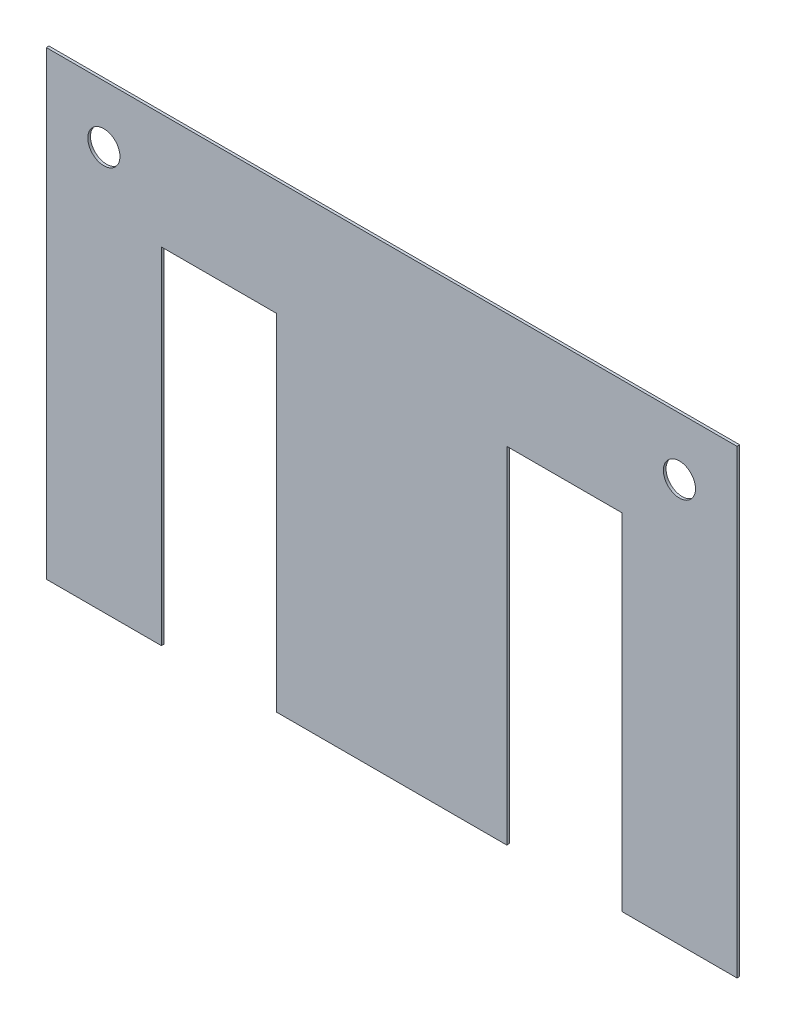
ISO-10303-21;
HEADER;
FILE_DESCRIPTION(('STEP AP214'),'2;1');
FILE_NAME('part.step','',(''),(''),'','','');
FILE_SCHEMA(('AUTOMOTIVE_DESIGN { 1 0 10303 214 1 1 1 1 }'));
ENDSEC;
DATA;
#1=APPLICATION_CONTEXT('core data for automotive mechanical design processes');
#2=APPLICATION_PROTOCOL_DEFINITION('international standard','automotive_design',2000,#1);
#3=PRODUCT_CONTEXT('',#1,'mechanical');
#4=PRODUCT('Part','Part','',(#3));
#5=PRODUCT_RELATED_PRODUCT_CATEGORY('part','',(#4));
#6=PRODUCT_DEFINITION_FORMATION('','',#4);
#7=PRODUCT_DEFINITION_CONTEXT('part definition',#1,'design');
#8=PRODUCT_DEFINITION('design','',#6,#7);
#9=PRODUCT_DEFINITION_SHAPE('','',#8);
#10=(LENGTH_UNIT() NAMED_UNIT(*) SI_UNIT(.MILLI.,.METRE.));
#11=(NAMED_UNIT(*) PLANE_ANGLE_UNIT() SI_UNIT($,.RADIAN.));
#12=(NAMED_UNIT(*) SI_UNIT($,.STERADIAN.) SOLID_ANGLE_UNIT());
#13=UNCERTAINTY_MEASURE_WITH_UNIT(LENGTH_MEASURE(1.E-05),#10,'distance_accuracy_value','');
#14=(GEOMETRIC_REPRESENTATION_CONTEXT(3) GLOBAL_UNCERTAINTY_ASSIGNED_CONTEXT((#13)) GLOBAL_UNIT_ASSIGNED_CONTEXT((#10,
#11,#12)) REPRESENTATION_CONTEXT('',''));
#15=CARTESIAN_POINT('',(0.,0.,0.));
#16=DIRECTION('',(0.,0.,1.));
#17=DIRECTION('',(1.,0.,0.));
#18=AXIS2_PLACEMENT_3D('',#15,#16,#17);
#19=CARTESIAN_POINT('',(0.,0.,0.5));
#20=DIRECTION('',(0.,0.,-1.));
#21=DIRECTION('',(-1.,0.,0.));
#22=AXIS2_PLACEMENT_3D('',#19,#20,#21);
#23=PLANE('',#22);
#24=CARTESIAN_POINT('',(10.75,75.25,0.5));
#25=DIRECTION('',(0.,0.,1.));
#26=DIRECTION('',(1.,0.,0.));
#27=AXIS2_PLACEMENT_3D('',#24,#25,#26);
#28=CIRCLE('',#27,3.);
#29=CARTESIAN_POINT('',(13.75,75.25,0.5));
#30=VERTEX_POINT('',#29);
#31=EDGE_CURVE('E159',#30,#30,#28,.T.);
#32=ORIENTED_EDGE('',*,*,#31,.F.);
#33=EDGE_LOOP('',(#32));
#34=FACE_BOUND('',#33,.T.);
#35=DIRECTION('',(1.,0.,0.));
#36=VECTOR('',#35,1.);
#37=CARTESIAN_POINT('',(21.5000000000001,0.,0.5));
#38=LINE('',#37,#36);
#39=CARTESIAN_POINT('',(0.,0.,0.5));
#40=VERTEX_POINT('',#39);
#41=CARTESIAN_POINT('',(21.5000000000001,0.,0.5));
#42=VERTEX_POINT('',#41);
#43=EDGE_CURVE('E178',#40,#42,#38,.T.);
#44=ORIENTED_EDGE('',*,*,#43,.T.);
#45=DIRECTION('',(0.,1.,0.));
#46=VECTOR('',#45,1.);
#47=CARTESIAN_POINT('',(21.5000000000001,64.5,0.5));
#48=LINE('',#47,#46);
#49=CARTESIAN_POINT('',(21.5000000000001,64.5,0.5));
#50=VERTEX_POINT('',#49);
#51=EDGE_CURVE('E106',#42,#50,#48,.T.);
#52=ORIENTED_EDGE('',*,*,#51,.T.);
#53=DIRECTION('',(1.,0.,0.));
#54=VECTOR('',#53,1.);
#55=CARTESIAN_POINT('',(43.0000000000001,64.5,0.5));
#56=LINE('',#55,#54);
#57=CARTESIAN_POINT('',(43.0000000000001,64.5,0.5));
#58=VERTEX_POINT('',#57);
#59=EDGE_CURVE('E205',#50,#58,#56,.T.);
#60=ORIENTED_EDGE('',*,*,#59,.T.);
#61=DIRECTION('',(0.,-1.,0.));
#62=VECTOR('',#61,1.);
#63=CARTESIAN_POINT('',(43.,0.,0.5));
#64=LINE('',#63,#62);
#65=CARTESIAN_POINT('',(43.,0.,0.5));
#66=VERTEX_POINT('',#65);
#67=EDGE_CURVE('E224',#58,#66,#64,.T.);
#68=ORIENTED_EDGE('',*,*,#67,.T.);
#69=DIRECTION('',(1.,0.,0.));
#70=VECTOR('',#69,1.);
#71=CARTESIAN_POINT('',(86.,0.,0.5));
#72=LINE('',#71,#70);
#73=CARTESIAN_POINT('',(86.,0.,0.5));
#74=VERTEX_POINT('',#73);
#75=EDGE_CURVE('E221',#66,#74,#72,.T.);
#76=ORIENTED_EDGE('',*,*,#75,.T.);
#77=DIRECTION('',(0.,1.,0.));
#78=VECTOR('',#77,1.);
#79=CARTESIAN_POINT('',(86.,64.5,0.5));
#80=LINE('',#79,#78);
#81=CARTESIAN_POINT('',(86.,64.5,0.5));
#82=VERTEX_POINT('',#81);
#83=EDGE_CURVE('E223',#74,#82,#80,.T.);
#84=ORIENTED_EDGE('',*,*,#83,.T.);
#85=DIRECTION('',(1.,0.,0.));
#86=VECTOR('',#85,1.);
#87=CARTESIAN_POINT('',(107.5,64.5,0.5));
#88=LINE('',#87,#86);
#89=CARTESIAN_POINT('',(107.5,64.5,0.5));
#90=VERTEX_POINT('',#89);
#91=EDGE_CURVE('E226',#82,#90,#88,.T.);
#92=ORIENTED_EDGE('',*,*,#91,.T.);
#93=DIRECTION('',(0.,-1.,0.));
#94=VECTOR('',#93,1.);
#95=CARTESIAN_POINT('',(107.5,0.,0.5));
#96=LINE('',#95,#94);
#97=CARTESIAN_POINT('',(107.5,0.,0.5));
#98=VERTEX_POINT('',#97);
#99=EDGE_CURVE('E232',#90,#98,#96,.T.);
#100=ORIENTED_EDGE('',*,*,#99,.T.);
#101=DIRECTION('',(1.,0.,0.));
#102=VECTOR('',#101,1.);
#103=CARTESIAN_POINT('',(129.,0.,0.5));
#104=LINE('',#103,#102);
#105=CARTESIAN_POINT('',(129.,0.,0.5));
#106=VERTEX_POINT('',#105);
#107=EDGE_CURVE('E137',#98,#106,#104,.T.);
#108=ORIENTED_EDGE('',*,*,#107,.T.);
#109=DIRECTION('',(0.,1.,0.));
#110=VECTOR('',#109,1.);
#111=CARTESIAN_POINT('',(129.,86.,0.5));
#112=LINE('',#111,#110);
#113=CARTESIAN_POINT('',(129.,86.,0.5));
#114=VERTEX_POINT('',#113);
#115=EDGE_CURVE('E131',#106,#114,#112,.T.);
#116=ORIENTED_EDGE('',*,*,#115,.T.);
#117=DIRECTION('',(-1.,0.,0.));
#118=VECTOR('',#117,1.);
#119=CARTESIAN_POINT('',(0.,86.,0.5));
#120=LINE('',#119,#118);
#121=CARTESIAN_POINT('',(0.,86.,0.5));
#122=VERTEX_POINT('',#121);
#123=EDGE_CURVE('E135',#114,#122,#120,.T.);
#124=ORIENTED_EDGE('',*,*,#123,.T.);
#125=DIRECTION('',(0.,-1.,0.));
#126=VECTOR('',#125,1.);
#127=CARTESIAN_POINT('',(0.,0.,0.5));
#128=LINE('',#127,#126);
#129=EDGE_CURVE('E51',#122,#40,#128,.T.);
#130=ORIENTED_EDGE('',*,*,#129,.T.);
#131=EDGE_LOOP('',(#44,#52,#60,#68,#76,#84,#92,#100,#108,#116,#124,#130));
#132=FACE_BOUND('',#131,.T.);
#133=CARTESIAN_POINT('',(118.25,75.25,0.5));
#134=DIRECTION('',(0.,0.,1.));
#135=DIRECTION('',(1.,0.,0.));
#136=AXIS2_PLACEMENT_3D('',#133,#134,#135);
#137=CIRCLE('',#136,3.00000000000001);
#138=CARTESIAN_POINT('',(121.25,75.25,0.5));
#139=VERTEX_POINT('',#138);
#140=EDGE_CURVE('E275',#139,#139,#137,.T.);
#141=ORIENTED_EDGE('',*,*,#140,.F.);
#142=EDGE_LOOP('',(#141));
#143=FACE_BOUND('',#142,.T.);
#144=ADVANCED_FACE('F34',(#34,#132,#143),#23,.F.);
#145=CARTESIAN_POINT('',(0.,0.,0.));
#146=DIRECTION('',(0.,0.,-1.));
#147=DIRECTION('',(-1.,0.,0.));
#148=AXIS2_PLACEMENT_3D('',#145,#146,#147);
#149=PLANE('',#148);
#150=CARTESIAN_POINT('',(10.75,75.25,0.));
#151=DIRECTION('',(0.,0.,1.));
#152=DIRECTION('',(1.,0.,0.));
#153=AXIS2_PLACEMENT_3D('',#150,#151,#152);
#154=CIRCLE('',#153,3.);
#155=CARTESIAN_POINT('',(13.75,75.25,0.));
#156=VERTEX_POINT('',#155);
#157=EDGE_CURVE('E280',#156,#156,#154,.T.);
#158=ORIENTED_EDGE('',*,*,#157,.T.);
#159=EDGE_LOOP('',(#158));
#160=FACE_BOUND('',#159,.T.);
#161=DIRECTION('',(1.,0.,0.));
#162=VECTOR('',#161,1.);
#163=CARTESIAN_POINT('',(21.5000000000001,0.,0.));
#164=LINE('',#163,#162);
#165=CARTESIAN_POINT('',(0.,0.,0.));
#166=VERTEX_POINT('',#165);
#167=CARTESIAN_POINT('',(21.5000000000001,0.,0.));
#168=VERTEX_POINT('',#167);
#169=EDGE_CURVE('E155',#166,#168,#164,.T.);
#170=ORIENTED_EDGE('',*,*,#169,.F.);
#171=DIRECTION('',(0.,-1.,0.));
#172=VECTOR('',#171,1.);
#173=CARTESIAN_POINT('',(0.,0.,0.));
#174=LINE('',#173,#172);
#175=CARTESIAN_POINT('',(0.,86.,0.));
#176=VERTEX_POINT('',#175);
#177=EDGE_CURVE('E98',#176,#166,#174,.T.);
#178=ORIENTED_EDGE('',*,*,#177,.F.);
#179=DIRECTION('',(-1.,0.,0.));
#180=VECTOR('',#179,1.);
#181=CARTESIAN_POINT('',(0.,86.,0.));
#182=LINE('',#181,#180);
#183=CARTESIAN_POINT('',(129.,86.,0.));
#184=VERTEX_POINT('',#183);
#185=EDGE_CURVE('E92',#184,#176,#182,.T.);
#186=ORIENTED_EDGE('',*,*,#185,.F.);
#187=DIRECTION('',(0.,1.,0.));
#188=VECTOR('',#187,1.);
#189=CARTESIAN_POINT('',(129.,86.,0.));
#190=LINE('',#189,#188);
#191=CARTESIAN_POINT('',(129.,0.,0.));
#192=VERTEX_POINT('',#191);
#193=EDGE_CURVE('E145',#192,#184,#190,.T.);
#194=ORIENTED_EDGE('',*,*,#193,.F.);
#195=DIRECTION('',(1.,0.,0.));
#196=VECTOR('',#195,1.);
#197=CARTESIAN_POINT('',(129.,0.,0.));
#198=LINE('',#197,#196);
#199=CARTESIAN_POINT('',(107.5,0.,0.));
#200=VERTEX_POINT('',#199);
#201=EDGE_CURVE('E173',#200,#192,#198,.T.);
#202=ORIENTED_EDGE('',*,*,#201,.F.);
#203=DIRECTION('',(0.,-1.,0.));
#204=VECTOR('',#203,1.);
#205=CARTESIAN_POINT('',(107.5,0.,0.));
#206=LINE('',#205,#204);
#207=CARTESIAN_POINT('',(107.5,64.5,0.));
#208=VERTEX_POINT('',#207);
#209=EDGE_CURVE('E171',#208,#200,#206,.T.);
#210=ORIENTED_EDGE('',*,*,#209,.F.);
#211=DIRECTION('',(1.,0.,0.));
#212=VECTOR('',#211,1.);
#213=CARTESIAN_POINT('',(107.5,64.5,0.));
#214=LINE('',#213,#212);
#215=CARTESIAN_POINT('',(86.,64.5,0.));
#216=VERTEX_POINT('',#215);
#217=EDGE_CURVE('E169',#216,#208,#214,.T.);
#218=ORIENTED_EDGE('',*,*,#217,.F.);
#219=DIRECTION('',(0.,1.,0.));
#220=VECTOR('',#219,1.);
#221=CARTESIAN_POINT('',(86.,64.5,0.));
#222=LINE('',#221,#220);
#223=CARTESIAN_POINT('',(86.,0.,0.));
#224=VERTEX_POINT('',#223);
#225=EDGE_CURVE('E167',#224,#216,#222,.T.);
#226=ORIENTED_EDGE('',*,*,#225,.F.);
#227=DIRECTION('',(1.,0.,0.));
#228=VECTOR('',#227,1.);
#229=CARTESIAN_POINT('',(86.,0.,0.));
#230=LINE('',#229,#228);
#231=CARTESIAN_POINT('',(43.,0.,0.));
#232=VERTEX_POINT('',#231);
#233=EDGE_CURVE('E165',#232,#224,#230,.T.);
#234=ORIENTED_EDGE('',*,*,#233,.F.);
#235=DIRECTION('',(0.,-1.,0.));
#236=VECTOR('',#235,1.);
#237=CARTESIAN_POINT('',(43.,0.,0.));
#238=LINE('',#237,#236);
#239=CARTESIAN_POINT('',(43.0000000000001,64.5,0.));
#240=VERTEX_POINT('',#239);
#241=EDGE_CURVE('E163',#240,#232,#238,.T.);
#242=ORIENTED_EDGE('',*,*,#241,.F.);
#243=DIRECTION('',(1.,0.,0.));
#244=VECTOR('',#243,1.);
#245=CARTESIAN_POINT('',(43.0000000000001,64.5,0.));
#246=LINE('',#245,#244);
#247=CARTESIAN_POINT('',(21.5000000000001,64.5,0.));
#248=VERTEX_POINT('',#247);
#249=EDGE_CURVE('E161',#248,#240,#246,.T.);
#250=ORIENTED_EDGE('',*,*,#249,.F.);
#251=DIRECTION('',(0.,1.,0.));
#252=VECTOR('',#251,1.);
#253=CARTESIAN_POINT('',(21.5000000000001,64.5,0.));
#254=LINE('',#253,#252);
#255=EDGE_CURVE('E158',#168,#248,#254,.T.);
#256=ORIENTED_EDGE('',*,*,#255,.F.);
#257=EDGE_LOOP('',(#170,#178,#186,#194,#202,#210,#218,#226,#234,#242,#250,#256));
#258=FACE_BOUND('',#257,.T.);
#259=CARTESIAN_POINT('',(118.25,75.25,0.));
#260=DIRECTION('',(0.,0.,1.));
#261=DIRECTION('',(1.,0.,0.));
#262=AXIS2_PLACEMENT_3D('',#259,#260,#261);
#263=CIRCLE('',#262,3.00000000000001);
#264=CARTESIAN_POINT('',(121.25,75.25,0.));
#265=VERTEX_POINT('',#264);
#266=EDGE_CURVE('E278',#265,#265,#263,.T.);
#267=ORIENTED_EDGE('',*,*,#266,.T.);
#268=EDGE_LOOP('',(#267));
#269=FACE_BOUND('',#268,.T.);
#270=ADVANCED_FACE('F209',(#160,#258,#269),#149,.T.);
#271=CARTESIAN_POINT('',(21.5000000000001,0.,0.5));
#272=DIRECTION('',(0.,1.,0.));
#273=DIRECTION('',(-1.,0.,0.));
#274=AXIS2_PLACEMENT_3D('',#271,#272,#273);
#275=PLANE('',#274);
#276=ORIENTED_EDGE('',*,*,#169,.T.);
#277=DIRECTION('',(0.,0.,-1.));
#278=VECTOR('',#277,1.);
#279=CARTESIAN_POINT('',(21.5000000000001,0.,0.5));
#280=LINE('',#279,#278);
#281=EDGE_CURVE('E11',#42,#168,#280,.T.);
#282=ORIENTED_EDGE('',*,*,#281,.F.);
#283=ORIENTED_EDGE('',*,*,#43,.F.);
#284=DIRECTION('',(0.,0.,-1.));
#285=VECTOR('',#284,1.);
#286=CARTESIAN_POINT('',(0.,0.,0.5));
#287=LINE('',#286,#285);
#288=EDGE_CURVE('E151',#40,#166,#287,.T.);
#289=ORIENTED_EDGE('',*,*,#288,.T.);
#290=EDGE_LOOP('',(#276,#282,#283,#289));
#291=FACE_BOUND('',#290,.T.);
#292=ADVANCED_FACE('F36',(#291),#275,.F.);
#293=CARTESIAN_POINT('',(21.5000000000001,64.5,0.5));
#294=DIRECTION('',(-1.,0.,0.));
#295=DIRECTION('',(0.,-1.,0.));
#296=AXIS2_PLACEMENT_3D('',#293,#294,#295);
#297=PLANE('',#296);
#298=ORIENTED_EDGE('',*,*,#255,.T.);
#299=DIRECTION('',(0.,0.,-1.));
#300=VECTOR('',#299,1.);
#301=CARTESIAN_POINT('',(21.5000000000001,64.5,0.5));
#302=LINE('',#301,#300);
#303=EDGE_CURVE('E43',#50,#248,#302,.T.);
#304=ORIENTED_EDGE('',*,*,#303,.F.);
#305=ORIENTED_EDGE('',*,*,#51,.F.);
#306=ORIENTED_EDGE('',*,*,#281,.T.);
#307=EDGE_LOOP('',(#298,#304,#305,#306));
#308=FACE_BOUND('',#307,.T.);
#309=ADVANCED_FACE('F373',(#308),#297,.F.);
#310=CARTESIAN_POINT('',(43.0000000000001,64.5,0.5));
#311=DIRECTION('',(0.,1.,0.));
#312=DIRECTION('',(0.,0.,1.));
#313=AXIS2_PLACEMENT_3D('',#310,#311,#312);
#314=PLANE('',#313);
#315=ORIENTED_EDGE('',*,*,#249,.T.);
#316=DIRECTION('',(0.,0.,-1.));
#317=VECTOR('',#316,1.);
#318=CARTESIAN_POINT('',(43.0000000000001,64.5,0.5));
#319=LINE('',#318,#317);
#320=EDGE_CURVE('E197',#58,#240,#319,.T.);
#321=ORIENTED_EDGE('',*,*,#320,.F.);
#322=ORIENTED_EDGE('',*,*,#59,.F.);
#323=ORIENTED_EDGE('',*,*,#303,.T.);
#324=EDGE_LOOP('',(#315,#321,#322,#323));
#325=FACE_BOUND('',#324,.T.);
#326=ADVANCED_FACE('F203',(#325),#314,.F.);
#327=CARTESIAN_POINT('',(43.,0.,0.5));
#328=DIRECTION('',(1.,0.,0.));
#329=DIRECTION('',(0.,1.,0.));
#330=AXIS2_PLACEMENT_3D('',#327,#328,#329);
#331=PLANE('',#330);
#332=ORIENTED_EDGE('',*,*,#241,.T.);
#333=DIRECTION('',(0.,0.,-1.));
#334=VECTOR('',#333,1.);
#335=CARTESIAN_POINT('',(43.,0.,0.5));
#336=LINE('',#335,#334);
#337=EDGE_CURVE('E194',#66,#232,#336,.T.);
#338=ORIENTED_EDGE('',*,*,#337,.F.);
#339=ORIENTED_EDGE('',*,*,#67,.F.);
#340=ORIENTED_EDGE('',*,*,#320,.T.);
#341=EDGE_LOOP('',(#332,#338,#339,#340));
#342=FACE_BOUND('',#341,.T.);
#343=ADVANCED_FACE('F215',(#342),#331,.F.);
#344=CARTESIAN_POINT('',(86.,0.,0.5));
#345=DIRECTION('',(0.,1.,0.));
#346=DIRECTION('',(-1.,0.,0.));
#347=AXIS2_PLACEMENT_3D('',#344,#345,#346);
#348=PLANE('',#347);
#349=ORIENTED_EDGE('',*,*,#233,.T.);
#350=DIRECTION('',(0.,0.,-1.));
#351=VECTOR('',#350,1.);
#352=CARTESIAN_POINT('',(86.,0.,0.5));
#353=LINE('',#352,#351);
#354=EDGE_CURVE('E191',#74,#224,#353,.T.);
#355=ORIENTED_EDGE('',*,*,#354,.F.);
#356=ORIENTED_EDGE('',*,*,#75,.F.);
#357=ORIENTED_EDGE('',*,*,#337,.T.);
#358=EDGE_LOOP('',(#349,#355,#356,#357));
#359=FACE_BOUND('',#358,.T.);
#360=ADVANCED_FACE('F219',(#359),#348,.F.);
#361=CARTESIAN_POINT('',(86.,64.5,0.5));
#362=DIRECTION('',(-1.,0.,0.));
#363=DIRECTION('',(0.,-1.,0.));
#364=AXIS2_PLACEMENT_3D('',#361,#362,#363);
#365=PLANE('',#364);
#366=ORIENTED_EDGE('',*,*,#225,.T.);
#367=DIRECTION('',(0.,0.,-1.));
#368=VECTOR('',#367,1.);
#369=CARTESIAN_POINT('',(86.,64.5,0.5));
#370=LINE('',#369,#368);
#371=EDGE_CURVE('E188',#82,#216,#370,.T.);
#372=ORIENTED_EDGE('',*,*,#371,.F.);
#373=ORIENTED_EDGE('',*,*,#83,.F.);
#374=ORIENTED_EDGE('',*,*,#354,.T.);
#375=EDGE_LOOP('',(#366,#372,#373,#374));
#376=FACE_BOUND('',#375,.T.);
#377=ADVANCED_FACE('F338',(#376),#365,.F.);
#378=CARTESIAN_POINT('',(107.5,64.5,0.5));
#379=DIRECTION('',(0.,1.,0.));
#380=DIRECTION('',(0.,0.,1.));
#381=AXIS2_PLACEMENT_3D('',#378,#379,#380);
#382=PLANE('',#381);
#383=ORIENTED_EDGE('',*,*,#217,.T.);
#384=DIRECTION('',(0.,0.,-1.));
#385=VECTOR('',#384,1.);
#386=CARTESIAN_POINT('',(107.5,64.5,0.5));
#387=LINE('',#386,#385);
#388=EDGE_CURVE('E185',#90,#208,#387,.T.);
#389=ORIENTED_EDGE('',*,*,#388,.F.);
#390=ORIENTED_EDGE('',*,*,#91,.F.);
#391=ORIENTED_EDGE('',*,*,#371,.T.);
#392=EDGE_LOOP('',(#383,#389,#390,#391));
#393=FACE_BOUND('',#392,.T.);
#394=ADVANCED_FACE('F329',(#393),#382,.F.);
#395=CARTESIAN_POINT('',(107.5,0.,0.5));
#396=DIRECTION('',(1.,0.,0.));
#397=DIRECTION('',(0.,0.,-1.));
#398=AXIS2_PLACEMENT_3D('',#395,#396,#397);
#399=PLANE('',#398);
#400=ORIENTED_EDGE('',*,*,#209,.T.);
#401=DIRECTION('',(0.,0.,-1.));
#402=VECTOR('',#401,1.);
#403=CARTESIAN_POINT('',(107.5,0.,0.5));
#404=LINE('',#403,#402);
#405=EDGE_CURVE('E182',#98,#200,#404,.T.);
#406=ORIENTED_EDGE('',*,*,#405,.F.);
#407=ORIENTED_EDGE('',*,*,#99,.F.);
#408=ORIENTED_EDGE('',*,*,#388,.T.);
#409=EDGE_LOOP('',(#400,#406,#407,#408));
#410=FACE_BOUND('',#409,.T.);
#411=ADVANCED_FACE('F238',(#410),#399,.F.);
#412=CARTESIAN_POINT('',(129.,0.,0.5));
#413=DIRECTION('',(0.,1.,0.));
#414=DIRECTION('',(-1.,0.,0.));
#415=AXIS2_PLACEMENT_3D('',#412,#413,#414);
#416=PLANE('',#415);
#417=ORIENTED_EDGE('',*,*,#201,.T.);
#418=DIRECTION('',(0.,0.,-1.));
#419=VECTOR('',#418,1.);
#420=CARTESIAN_POINT('',(129.,0.,0.5));
#421=LINE('',#420,#419);
#422=EDGE_CURVE('E146',#106,#192,#421,.T.);
#423=ORIENTED_EDGE('',*,*,#422,.F.);
#424=ORIENTED_EDGE('',*,*,#107,.F.);
#425=ORIENTED_EDGE('',*,*,#405,.T.);
#426=EDGE_LOOP('',(#417,#423,#424,#425));
#427=FACE_BOUND('',#426,.T.);
#428=ADVANCED_FACE('F242',(#427),#416,.F.);
#429=CARTESIAN_POINT('',(129.,86.,0.5));
#430=DIRECTION('',(-1.,0.,0.));
#431=DIRECTION('',(0.,0.,1.));
#432=AXIS2_PLACEMENT_3D('',#429,#430,#431);
#433=PLANE('',#432);
#434=ORIENTED_EDGE('',*,*,#193,.T.);
#435=DIRECTION('',(0.,0.,-1.));
#436=VECTOR('',#435,1.);
#437=CARTESIAN_POINT('',(129.,86.,0.5));
#438=LINE('',#437,#436);
#439=EDGE_CURVE('E142',#114,#184,#438,.T.);
#440=ORIENTED_EDGE('',*,*,#439,.F.);
#441=ORIENTED_EDGE('',*,*,#115,.F.);
#442=ORIENTED_EDGE('',*,*,#422,.T.);
#443=EDGE_LOOP('',(#434,#440,#441,#442));
#444=FACE_BOUND('',#443,.T.);
#445=ADVANCED_FACE('F143',(#444),#433,.F.);
#446=CARTESIAN_POINT('',(0.,86.,0.5));
#447=DIRECTION('',(0.,-1.,0.));
#448=DIRECTION('',(0.,0.,-1.));
#449=AXIS2_PLACEMENT_3D('',#446,#447,#448);
#450=PLANE('',#449);
#451=ORIENTED_EDGE('',*,*,#185,.T.);
#452=DIRECTION('',(0.,0.,-1.));
#453=VECTOR('',#452,1.);
#454=CARTESIAN_POINT('',(0.,86.,0.5));
#455=LINE('',#454,#453);
#456=EDGE_CURVE('E147',#122,#176,#455,.T.);
#457=ORIENTED_EDGE('',*,*,#456,.F.);
#458=ORIENTED_EDGE('',*,*,#123,.F.);
#459=ORIENTED_EDGE('',*,*,#439,.T.);
#460=EDGE_LOOP('',(#451,#457,#458,#459));
#461=FACE_BOUND('',#460,.T.);
#462=ADVANCED_FACE('F149',(#461),#450,.F.);
#463=CARTESIAN_POINT('',(0.,0.,0.5));
#464=DIRECTION('',(1.,0.,0.));
#465=DIRECTION('',(0.,0.,-1.));
#466=AXIS2_PLACEMENT_3D('',#463,#464,#465);
#467=PLANE('',#466);
#468=ORIENTED_EDGE('',*,*,#177,.T.);
#469=ORIENTED_EDGE('',*,*,#288,.F.);
#470=ORIENTED_EDGE('',*,*,#129,.F.);
#471=ORIENTED_EDGE('',*,*,#456,.T.);
#472=EDGE_LOOP('',(#468,#469,#470,#471));
#473=FACE_BOUND('',#472,.T.);
#474=ADVANCED_FACE('F246',(#473),#467,.F.);
#475=CARTESIAN_POINT('',(10.75,75.25,0.5));
#476=DIRECTION('',(0.,0.,-1.));
#477=DIRECTION('',(-1.,0.,0.));
#478=AXIS2_PLACEMENT_3D('',#475,#476,#477);
#479=CYLINDRICAL_SURFACE('',#478,3.);
#480=ORIENTED_EDGE('',*,*,#31,.T.);
#481=EDGE_LOOP('',(#480));
#482=FACE_BOUND('',#481,.T.);
#483=ORIENTED_EDGE('',*,*,#157,.F.);
#484=EDGE_LOOP('',(#483));
#485=FACE_BOUND('',#484,.T.);
#486=ADVANCED_FACE('F248',(#482,#485),#479,.F.);
#487=CARTESIAN_POINT('',(118.25,75.25,0.5));
#488=DIRECTION('',(0.,0.,-1.));
#489=DIRECTION('',(-1.,0.,0.));
#490=AXIS2_PLACEMENT_3D('',#487,#488,#489);
#491=CYLINDRICAL_SURFACE('',#490,3.00000000000001);
#492=ORIENTED_EDGE('',*,*,#140,.T.);
#493=EDGE_LOOP('',(#492));
#494=FACE_BOUND('',#493,.T.);
#495=ORIENTED_EDGE('',*,*,#266,.F.);
#496=EDGE_LOOP('',(#495));
#497=FACE_BOUND('',#496,.T.);
#498=ADVANCED_FACE('F254',(#494,#497),#491,.F.);
#499=CLOSED_SHELL('',(#144,#270,#292,#309,#326,#343,#360,#377,#394,#411,#428,#445,#462,#474,
#486,#498));
#500=MANIFOLD_SOLID_BREP('B2',#499);
#501=ADVANCED_BREP_SHAPE_REPRESENTATION('',(#18,#500),#14);
#502=SHAPE_DEFINITION_REPRESENTATION(#9,#501);
ENDSEC;
END-ISO-10303-21;
